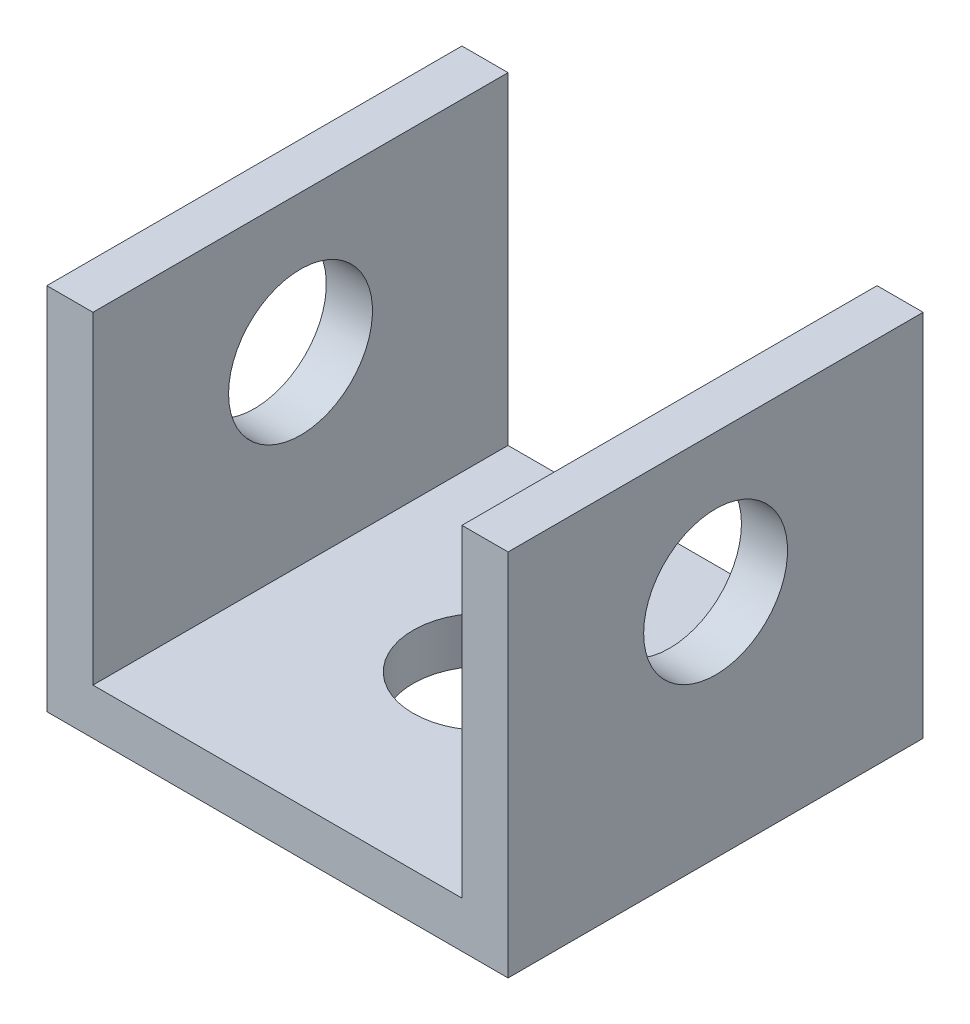
ISO-10303-21;
HEADER;
FILE_DESCRIPTION(('STEP AP214'),'2;1');
FILE_NAME('part.step','',(''),(''),'','','');
FILE_SCHEMA(('AUTOMOTIVE_DESIGN { 1 0 10303 214 1 1 1 1 }'));
ENDSEC;
DATA;
#1=APPLICATION_CONTEXT('core data for automotive mechanical design processes');
#2=APPLICATION_PROTOCOL_DEFINITION('international standard','automotive_design',2000,#1);
#3=PRODUCT_CONTEXT('',#1,'mechanical');
#4=PRODUCT('Part','Part','',(#3));
#5=PRODUCT_RELATED_PRODUCT_CATEGORY('part','',(#4));
#6=PRODUCT_DEFINITION_FORMATION('','',#4);
#7=PRODUCT_DEFINITION_CONTEXT('part definition',#1,'design');
#8=PRODUCT_DEFINITION('design','',#6,#7);
#9=PRODUCT_DEFINITION_SHAPE('','',#8);
#10=(LENGTH_UNIT() NAMED_UNIT(*) SI_UNIT(.MILLI.,.METRE.));
#11=(NAMED_UNIT(*) PLANE_ANGLE_UNIT() SI_UNIT($,.RADIAN.));
#12=(NAMED_UNIT(*) SI_UNIT($,.STERADIAN.) SOLID_ANGLE_UNIT());
#13=UNCERTAINTY_MEASURE_WITH_UNIT(LENGTH_MEASURE(1.E-05),#10,'distance_accuracy_value','');
#14=(GEOMETRIC_REPRESENTATION_CONTEXT(3) GLOBAL_UNCERTAINTY_ASSIGNED_CONTEXT((#13)) GLOBAL_UNIT_ASSIGNED_CONTEXT((#10,
#11,#12)) REPRESENTATION_CONTEXT('',''));
#15=CARTESIAN_POINT('',(0.,0.,0.));
#16=DIRECTION('',(0.,0.,1.));
#17=DIRECTION('',(1.,0.,0.));
#18=AXIS2_PLACEMENT_3D('',#15,#16,#17);
#19=CARTESIAN_POINT('',(0.,5.,0.));
#20=DIRECTION('',(0.,1.,0.));
#21=DIRECTION('',(0.,0.,1.));
#22=AXIS2_PLACEMENT_3D('',#19,#20,#21);
#23=PLANE('',#22);
#24=CARTESIAN_POINT('',(0.,5.,0.));
#25=DIRECTION('',(0.,1.,0.));
#26=DIRECTION('',(0.,0.,1.));
#27=AXIS2_PLACEMENT_3D('',#24,#25,#26);
#28=CIRCLE('',#27,7.8);
#29=CARTESIAN_POINT('',(0.,5.,7.8));
#30=VERTEX_POINT('',#29);
#31=EDGE_CURVE('E128',#30,#30,#28,.T.);
#32=ORIENTED_EDGE('',*,*,#31,.F.);
#33=EDGE_LOOP('',(#32));
#34=FACE_BOUND('',#33,.T.);
#35=DIRECTION('',(-1.,0.,0.));
#36=VECTOR('',#35,1.);
#37=CARTESIAN_POINT('',(25.,5.,-22.5));
#38=LINE('',#37,#36);
#39=CARTESIAN_POINT('',(20.,5.,-22.5));
#40=VERTEX_POINT('',#39);
#41=CARTESIAN_POINT('',(-20.,5.,-22.5));
#42=VERTEX_POINT('',#41);
#43=EDGE_CURVE('E61',#40,#42,#38,.T.);
#44=ORIENTED_EDGE('',*,*,#43,.T.);
#45=DIRECTION('',(0.,0.,-1.));
#46=VECTOR('',#45,1.);
#47=CARTESIAN_POINT('',(-20.,5.,-22.5));
#48=LINE('',#47,#46);
#49=CARTESIAN_POINT('',(-20.,5.,22.5));
#50=VERTEX_POINT('',#49);
#51=EDGE_CURVE('E56',#50,#42,#48,.T.);
#52=ORIENTED_EDGE('',*,*,#51,.F.);
#53=DIRECTION('',(1.,0.,0.));
#54=VECTOR('',#53,1.);
#55=CARTESIAN_POINT('',(25.,5.,22.5));
#56=LINE('',#55,#54);
#57=CARTESIAN_POINT('',(20.,5.,22.5));
#58=VERTEX_POINT('',#57);
#59=EDGE_CURVE('E156',#50,#58,#56,.T.);
#60=ORIENTED_EDGE('',*,*,#59,.T.);
#61=DIRECTION('',(0.,0.,1.));
#62=VECTOR('',#61,1.);
#63=CARTESIAN_POINT('',(20.,5.,-22.5));
#64=LINE('',#63,#62);
#65=EDGE_CURVE('E137',#40,#58,#64,.T.);
#66=ORIENTED_EDGE('',*,*,#65,.F.);
#67=EDGE_LOOP('',(#44,#52,#60,#66));
#68=FACE_BOUND('',#67,.T.);
#69=ADVANCED_FACE('F39',(#34,#68),#23,.T.);
#70=CARTESIAN_POINT('',(-25.,5.,22.5));
#71=DIRECTION('',(1.,0.,0.));
#72=DIRECTION('',(0.,0.,-1.));
#73=AXIS2_PLACEMENT_3D('',#70,#71,#72);
#74=PLANE('',#73);
#75=CARTESIAN_POINT('',(-25.,25.,0.));
#76=DIRECTION('',(-1.,0.,0.));
#77=DIRECTION('',(0.,0.,1.));
#78=AXIS2_PLACEMENT_3D('',#75,#76,#77);
#79=CIRCLE('',#78,7.8);
#80=CARTESIAN_POINT('',(-25.,25.,7.80000000000001));
#81=VERTEX_POINT('',#80);
#82=EDGE_CURVE('E185',#81,#81,#79,.T.);
#83=ORIENTED_EDGE('',*,*,#82,.F.);
#84=EDGE_LOOP('',(#83));
#85=FACE_BOUND('',#84,.T.);
#86=DIRECTION('',(0.,0.,1.));
#87=VECTOR('',#86,1.);
#88=CARTESIAN_POINT('',(-25.,0.,22.5));
#89=LINE('',#88,#87);
#90=CARTESIAN_POINT('',(-25.,0.,-22.5));
#91=VERTEX_POINT('',#90);
#92=CARTESIAN_POINT('',(-25.,0.,22.5));
#93=VERTEX_POINT('',#92);
#94=EDGE_CURVE('E109',#91,#93,#89,.T.);
#95=ORIENTED_EDGE('',*,*,#94,.T.);
#96=DIRECTION('',(0.,-1.,0.));
#97=VECTOR('',#96,1.);
#98=CARTESIAN_POINT('',(-25.,5.,22.5));
#99=LINE('',#98,#97);
#100=CARTESIAN_POINT('',(-25.,40.,22.5));
#101=VERTEX_POINT('',#100);
#102=EDGE_CURVE('E11',#101,#93,#99,.T.);
#103=ORIENTED_EDGE('',*,*,#102,.F.);
#104=DIRECTION('',(0.,0.,1.));
#105=VECTOR('',#104,1.);
#106=CARTESIAN_POINT('',(-25.,40.,-22.5));
#107=LINE('',#106,#105);
#108=CARTESIAN_POINT('',(-25.,40.,-22.5));
#109=VERTEX_POINT('',#108);
#110=EDGE_CURVE('E107',#109,#101,#107,.T.);
#111=ORIENTED_EDGE('',*,*,#110,.F.);
#112=DIRECTION('',(0.,-1.,0.));
#113=VECTOR('',#112,1.);
#114=CARTESIAN_POINT('',(-25.,5.,-22.5));
#115=LINE('',#114,#113);
#116=EDGE_CURVE('E160',#109,#91,#115,.T.);
#117=ORIENTED_EDGE('',*,*,#116,.T.);
#118=EDGE_LOOP('',(#95,#103,#111,#117));
#119=FACE_BOUND('',#118,.T.);
#120=ADVANCED_FACE('F41',(#85,#119),#74,.F.);
#121=CARTESIAN_POINT('',(25.,5.,22.5));
#122=DIRECTION('',(0.,0.,-1.));
#123=DIRECTION('',(-1.,0.,0.));
#124=AXIS2_PLACEMENT_3D('',#121,#122,#123);
#125=PLANE('',#124);
#126=DIRECTION('',(1.,0.,0.));
#127=VECTOR('',#126,1.);
#128=CARTESIAN_POINT('',(25.,0.,22.5));
#129=LINE('',#128,#127);
#130=CARTESIAN_POINT('',(25.,0.,22.5));
#131=VERTEX_POINT('',#130);
#132=EDGE_CURVE('E162',#93,#131,#129,.T.);
#133=ORIENTED_EDGE('',*,*,#132,.T.);
#134=DIRECTION('',(0.,-1.,0.));
#135=VECTOR('',#134,1.);
#136=CARTESIAN_POINT('',(25.,5.,22.5));
#137=LINE('',#136,#135);
#138=CARTESIAN_POINT('',(25.,40.,22.5));
#139=VERTEX_POINT('',#138);
#140=EDGE_CURVE('E48',#139,#131,#137,.T.);
#141=ORIENTED_EDGE('',*,*,#140,.F.);
#142=DIRECTION('',(1.,0.,0.));
#143=VECTOR('',#142,1.);
#144=CARTESIAN_POINT('',(25.,40.,22.5));
#145=LINE('',#144,#143);
#146=CARTESIAN_POINT('',(20.,40.,22.5));
#147=VERTEX_POINT('',#146);
#148=EDGE_CURVE('E145',#147,#139,#145,.T.);
#149=ORIENTED_EDGE('',*,*,#148,.F.);
#150=DIRECTION('',(0.,-1.,0.));
#151=VECTOR('',#150,1.);
#152=CARTESIAN_POINT('',(20.,40.,22.5));
#153=LINE('',#152,#151);
#154=EDGE_CURVE('E148',#147,#58,#153,.T.);
#155=ORIENTED_EDGE('',*,*,#154,.T.);
#156=ORIENTED_EDGE('',*,*,#59,.F.);
#157=DIRECTION('',(0.,-1.,0.));
#158=VECTOR('',#157,1.);
#159=CARTESIAN_POINT('',(-20.,40.,22.5));
#160=LINE('',#159,#158);
#161=CARTESIAN_POINT('',(-20.,40.,22.5));
#162=VERTEX_POINT('',#161);
#163=EDGE_CURVE('E115',#162,#50,#160,.T.);
#164=ORIENTED_EDGE('',*,*,#163,.F.);
#165=DIRECTION('',(1.,0.,0.));
#166=VECTOR('',#165,1.);
#167=CARTESIAN_POINT('',(-25.,40.,22.5));
#168=LINE('',#167,#166);
#169=EDGE_CURVE('E112',#101,#162,#168,.T.);
#170=ORIENTED_EDGE('',*,*,#169,.F.);
#171=ORIENTED_EDGE('',*,*,#102,.T.);
#172=EDGE_LOOP('',(#133,#141,#149,#155,#156,#164,#170,#171));
#173=FACE_BOUND('',#172,.T.);
#174=ADVANCED_FACE('F113',(#173),#125,.F.);
#175=CARTESIAN_POINT('',(25.,5.,22.5));
#176=DIRECTION('',(-1.,0.,0.));
#177=DIRECTION('',(0.,0.,1.));
#178=AXIS2_PLACEMENT_3D('',#175,#176,#177);
#179=PLANE('',#178);
#180=CARTESIAN_POINT('',(25.,25.,0.));
#181=DIRECTION('',(-1.,0.,0.));
#182=DIRECTION('',(0.,0.,1.));
#183=AXIS2_PLACEMENT_3D('',#180,#181,#182);
#184=CIRCLE('',#183,7.8);
#185=CARTESIAN_POINT('',(25.,25.,7.80000000000001));
#186=VERTEX_POINT('',#185);
#187=EDGE_CURVE('E183',#186,#186,#184,.T.);
#188=ORIENTED_EDGE('',*,*,#187,.T.);
#189=EDGE_LOOP('',(#188));
#190=FACE_BOUND('',#189,.T.);
#191=DIRECTION('',(0.,0.,-1.));
#192=VECTOR('',#191,1.);
#193=CARTESIAN_POINT('',(25.,0.,22.5));
#194=LINE('',#193,#192);
#195=CARTESIAN_POINT('',(25.,0.,-22.5));
#196=VERTEX_POINT('',#195);
#197=EDGE_CURVE('E164',#131,#196,#194,.T.);
#198=ORIENTED_EDGE('',*,*,#197,.T.);
#199=DIRECTION('',(0.,-1.,0.));
#200=VECTOR('',#199,1.);
#201=CARTESIAN_POINT('',(25.,5.,-22.5));
#202=LINE('',#201,#200);
#203=CARTESIAN_POINT('',(25.,40.,-22.5));
#204=VERTEX_POINT('',#203);
#205=EDGE_CURVE('E168',#204,#196,#202,.T.);
#206=ORIENTED_EDGE('',*,*,#205,.F.);
#207=DIRECTION('',(0.,0.,-1.));
#208=VECTOR('',#207,1.);
#209=CARTESIAN_POINT('',(25.,40.,-22.5));
#210=LINE('',#209,#208);
#211=EDGE_CURVE('E138',#139,#204,#210,.T.);
#212=ORIENTED_EDGE('',*,*,#211,.F.);
#213=ORIENTED_EDGE('',*,*,#140,.T.);
#214=EDGE_LOOP('',(#198,#206,#212,#213));
#215=FACE_BOUND('',#214,.T.);
#216=ADVANCED_FACE('F191',(#190,#215),#179,.F.);
#217=CARTESIAN_POINT('',(25.,5.,-22.5));
#218=DIRECTION('',(0.,0.,1.));
#219=DIRECTION('',(1.,0.,0.));
#220=AXIS2_PLACEMENT_3D('',#217,#218,#219);
#221=PLANE('',#220);
#222=DIRECTION('',(-1.,0.,0.));
#223=VECTOR('',#222,1.);
#224=CARTESIAN_POINT('',(25.,0.,-22.5));
#225=LINE('',#224,#223);
#226=EDGE_CURVE('E158',#196,#91,#225,.T.);
#227=ORIENTED_EDGE('',*,*,#226,.T.);
#228=ORIENTED_EDGE('',*,*,#116,.F.);
#229=DIRECTION('',(-1.,0.,0.));
#230=VECTOR('',#229,1.);
#231=CARTESIAN_POINT('',(-25.,40.,-22.5));
#232=LINE('',#231,#230);
#233=CARTESIAN_POINT('',(-20.,40.,-22.5));
#234=VERTEX_POINT('',#233);
#235=EDGE_CURVE('E123',#234,#109,#232,.T.);
#236=ORIENTED_EDGE('',*,*,#235,.F.);
#237=DIRECTION('',(0.,-1.,0.));
#238=VECTOR('',#237,1.);
#239=CARTESIAN_POINT('',(-20.,40.,-22.5));
#240=LINE('',#239,#238);
#241=EDGE_CURVE('E132',#234,#42,#240,.T.);
#242=ORIENTED_EDGE('',*,*,#241,.T.);
#243=ORIENTED_EDGE('',*,*,#43,.F.);
#244=DIRECTION('',(0.,-1.,0.));
#245=VECTOR('',#244,1.);
#246=CARTESIAN_POINT('',(20.,40.,-22.5));
#247=LINE('',#246,#245);
#248=CARTESIAN_POINT('',(20.,40.,-22.5));
#249=VERTEX_POINT('',#248);
#250=EDGE_CURVE('E153',#249,#40,#247,.T.);
#251=ORIENTED_EDGE('',*,*,#250,.F.);
#252=DIRECTION('',(-1.,0.,0.));
#253=VECTOR('',#252,1.);
#254=CARTESIAN_POINT('',(25.,40.,-22.5));
#255=LINE('',#254,#253);
#256=EDGE_CURVE('E141',#204,#249,#255,.T.);
#257=ORIENTED_EDGE('',*,*,#256,.F.);
#258=ORIENTED_EDGE('',*,*,#205,.T.);
#259=EDGE_LOOP('',(#227,#228,#236,#242,#243,#251,#257,#258));
#260=FACE_BOUND('',#259,.T.);
#261=ADVANCED_FACE('F219',(#260),#221,.F.);
#262=CARTESIAN_POINT('',(0.,0.,0.));
#263=DIRECTION('',(0.,1.,0.));
#264=DIRECTION('',(0.,0.,1.));
#265=AXIS2_PLACEMENT_3D('',#262,#263,#264);
#266=PLANE('',#265);
#267=CARTESIAN_POINT('',(0.,0.,0.));
#268=DIRECTION('',(0.,1.,0.));
#269=DIRECTION('',(0.,0.,1.));
#270=AXIS2_PLACEMENT_3D('',#267,#268,#269);
#271=CIRCLE('',#270,7.8);
#272=CARTESIAN_POINT('',(0.,0.,7.8));
#273=VERTEX_POINT('',#272);
#274=EDGE_CURVE('E125',#273,#273,#271,.T.);
#275=ORIENTED_EDGE('',*,*,#274,.T.);
#276=EDGE_LOOP('',(#275));
#277=FACE_BOUND('',#276,.T.);
#278=ORIENTED_EDGE('',*,*,#94,.F.);
#279=ORIENTED_EDGE('',*,*,#226,.F.);
#280=ORIENTED_EDGE('',*,*,#197,.F.);
#281=ORIENTED_EDGE('',*,*,#132,.F.);
#282=EDGE_LOOP('',(#278,#279,#280,#281));
#283=FACE_BOUND('',#282,.T.);
#284=ADVANCED_FACE('F216',(#277,#283),#266,.F.);
#285=CARTESIAN_POINT('',(20.,40.,-22.5));
#286=DIRECTION('',(1.,0.,0.));
#287=DIRECTION('',(0.,0.,-1.));
#288=AXIS2_PLACEMENT_3D('',#285,#286,#287);
#289=PLANE('',#288);
#290=CARTESIAN_POINT('',(20.,25.,0.));
#291=DIRECTION('',(1.,0.,0.));
#292=DIRECTION('',(0.,0.,-1.));
#293=AXIS2_PLACEMENT_3D('',#290,#291,#292);
#294=CIRCLE('',#293,7.8);
#295=CARTESIAN_POINT('',(20.,25.,-7.8));
#296=VERTEX_POINT('',#295);
#297=EDGE_CURVE('E176',#296,#296,#294,.T.);
#298=ORIENTED_EDGE('',*,*,#297,.T.);
#299=EDGE_LOOP('',(#298));
#300=FACE_BOUND('',#299,.T.);
#301=ORIENTED_EDGE('',*,*,#65,.T.);
#302=ORIENTED_EDGE('',*,*,#154,.F.);
#303=DIRECTION('',(0.,0.,1.));
#304=VECTOR('',#303,1.);
#305=CARTESIAN_POINT('',(20.,40.,-22.5));
#306=LINE('',#305,#304);
#307=EDGE_CURVE('E143',#249,#147,#306,.T.);
#308=ORIENTED_EDGE('',*,*,#307,.F.);
#309=ORIENTED_EDGE('',*,*,#250,.T.);
#310=EDGE_LOOP('',(#301,#302,#308,#309));
#311=FACE_BOUND('',#310,.T.);
#312=ADVANCED_FACE('F214',(#300,#311),#289,.F.);
#313=CARTESIAN_POINT('',(0.,40.,0.));
#314=DIRECTION('',(0.,-1.,0.));
#315=DIRECTION('',(0.,0.,-1.));
#316=AXIS2_PLACEMENT_3D('',#313,#314,#315);
#317=PLANE('',#316);
#318=ORIENTED_EDGE('',*,*,#211,.T.);
#319=ORIENTED_EDGE('',*,*,#256,.T.);
#320=ORIENTED_EDGE('',*,*,#307,.T.);
#321=ORIENTED_EDGE('',*,*,#148,.T.);
#322=EDGE_LOOP('',(#318,#319,#320,#321));
#323=FACE_BOUND('',#322,.T.);
#324=ADVANCED_FACE('F249',(#323),#317,.F.);
#325=CARTESIAN_POINT('',(-20.,40.,-22.5));
#326=DIRECTION('',(-1.,0.,0.));
#327=DIRECTION('',(0.,0.,1.));
#328=AXIS2_PLACEMENT_3D('',#325,#326,#327);
#329=PLANE('',#328);
#330=CARTESIAN_POINT('',(-20.,25.,0.));
#331=DIRECTION('',(-1.,0.,0.));
#332=DIRECTION('',(0.,0.,1.));
#333=AXIS2_PLACEMENT_3D('',#330,#331,#332);
#334=CIRCLE('',#333,7.8);
#335=CARTESIAN_POINT('',(-20.,25.,7.80000000000001));
#336=VERTEX_POINT('',#335);
#337=EDGE_CURVE('E43',#336,#336,#334,.T.);
#338=ORIENTED_EDGE('',*,*,#337,.T.);
#339=EDGE_LOOP('',(#338));
#340=FACE_BOUND('',#339,.T.);
#341=ORIENTED_EDGE('',*,*,#51,.T.);
#342=ORIENTED_EDGE('',*,*,#241,.F.);
#343=DIRECTION('',(0.,0.,-1.));
#344=VECTOR('',#343,1.);
#345=CARTESIAN_POINT('',(-20.,40.,-22.5));
#346=LINE('',#345,#344);
#347=EDGE_CURVE('E118',#162,#234,#346,.T.);
#348=ORIENTED_EDGE('',*,*,#347,.F.);
#349=ORIENTED_EDGE('',*,*,#163,.T.);
#350=EDGE_LOOP('',(#341,#342,#348,#349));
#351=FACE_BOUND('',#350,.T.);
#352=ADVANCED_FACE('F255',(#340,#351),#329,.F.);
#353=CARTESIAN_POINT('',(0.,40.,0.));
#354=DIRECTION('',(0.,1.,0.));
#355=DIRECTION('',(0.,0.,1.));
#356=AXIS2_PLACEMENT_3D('',#353,#354,#355);
#357=PLANE('',#356);
#358=ORIENTED_EDGE('',*,*,#110,.T.);
#359=ORIENTED_EDGE('',*,*,#169,.T.);
#360=ORIENTED_EDGE('',*,*,#347,.T.);
#361=ORIENTED_EDGE('',*,*,#235,.T.);
#362=EDGE_LOOP('',(#358,#359,#360,#361));
#363=FACE_BOUND('',#362,.T.);
#364=ADVANCED_FACE('F121',(#363),#357,.T.);
#365=CARTESIAN_POINT('',(0.,-5.,0.));
#366=DIRECTION('',(0.,1.,0.));
#367=DIRECTION('',(0.,0.,1.));
#368=AXIS2_PLACEMENT_3D('',#365,#366,#367);
#369=CYLINDRICAL_SURFACE('',#368,7.8);
#370=ORIENTED_EDGE('',*,*,#31,.T.);
#371=EDGE_LOOP('',(#370));
#372=FACE_BOUND('',#371,.T.);
#373=ORIENTED_EDGE('',*,*,#274,.F.);
#374=EDGE_LOOP('',(#373));
#375=FACE_BOUND('',#374,.T.);
#376=ADVANCED_FACE('F202',(#372,#375),#369,.F.);
#377=CARTESIAN_POINT('',(25.,25.,0.));
#378=DIRECTION('',(-1.,0.,0.));
#379=DIRECTION('',(0.,0.,1.));
#380=AXIS2_PLACEMENT_3D('',#377,#378,#379);
#381=CYLINDRICAL_SURFACE('',#380,7.8);
#382=ORIENTED_EDGE('',*,*,#82,.T.);
#383=EDGE_LOOP('',(#382));
#384=FACE_BOUND('',#383,.T.);
#385=ORIENTED_EDGE('',*,*,#337,.F.);
#386=EDGE_LOOP('',(#385));
#387=FACE_BOUND('',#386,.T.);
#388=ADVANCED_FACE('F197',(#384,#387),#381,.F.);
#389=ORIENTED_EDGE('',*,*,#187,.F.);
#390=EDGE_LOOP('',(#389));
#391=FACE_BOUND('',#390,.T.);
#392=ORIENTED_EDGE('',*,*,#297,.F.);
#393=EDGE_LOOP('',(#392));
#394=FACE_BOUND('',#393,.T.);
#395=ADVANCED_FACE('F194',(#391,#394),#381,.F.);
#396=CLOSED_SHELL('',(#69,#120,#174,#216,#261,#284,#312,#324,#352,#364,#376,#388,#395));
#397=MANIFOLD_SOLID_BREP('B2',#396);
#398=ADVANCED_BREP_SHAPE_REPRESENTATION('',(#18,#397),#14);
#399=SHAPE_DEFINITION_REPRESENTATION(#9,#398);
ENDSEC;
END-ISO-10303-21;
